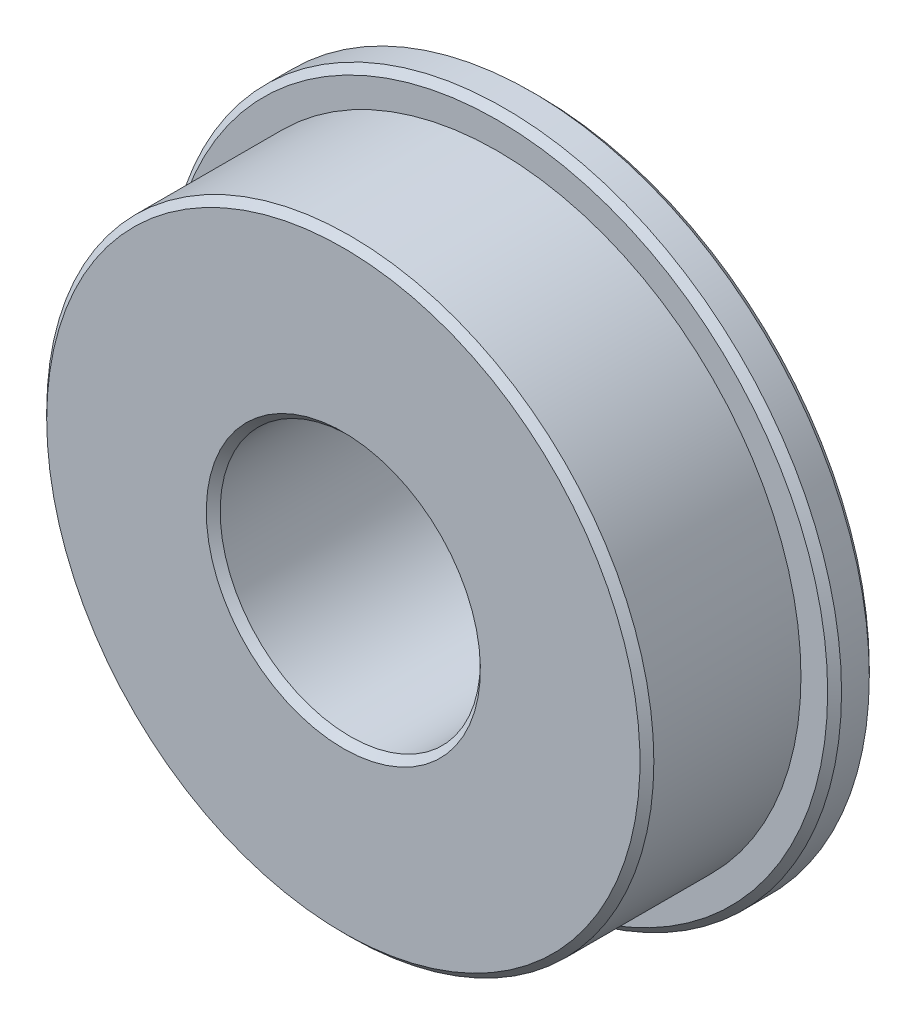
ISO-10303-21;
HEADER;
FILE_DESCRIPTION(('STEP AP214'),'2;1');
FILE_NAME('part.step','',(''),(''),'','','');
FILE_SCHEMA(('AUTOMOTIVE_DESIGN { 1 0 10303 214 1 1 1 1 }'));
ENDSEC;
DATA;
#1=APPLICATION_CONTEXT('core data for automotive mechanical design processes');
#2=APPLICATION_PROTOCOL_DEFINITION('international standard','automotive_design',2000,#1);
#3=PRODUCT_CONTEXT('',#1,'mechanical');
#4=PRODUCT('Part','Part','',(#3));
#5=PRODUCT_RELATED_PRODUCT_CATEGORY('part','',(#4));
#6=PRODUCT_DEFINITION_FORMATION('','',#4);
#7=PRODUCT_DEFINITION_CONTEXT('part definition',#1,'design');
#8=PRODUCT_DEFINITION('design','',#6,#7);
#9=PRODUCT_DEFINITION_SHAPE('','',#8);
#10=(LENGTH_UNIT() NAMED_UNIT(*) SI_UNIT(.MILLI.,.METRE.));
#11=(NAMED_UNIT(*) PLANE_ANGLE_UNIT() SI_UNIT($,.RADIAN.));
#12=(NAMED_UNIT(*) SI_UNIT($,.STERADIAN.) SOLID_ANGLE_UNIT());
#13=UNCERTAINTY_MEASURE_WITH_UNIT(LENGTH_MEASURE(1.E-05),#10,'distance_accuracy_value','');
#14=(GEOMETRIC_REPRESENTATION_CONTEXT(3) GLOBAL_UNCERTAINTY_ASSIGNED_CONTEXT((#13)) GLOBAL_UNIT_ASSIGNED_CONTEXT((#10,
#11,#12)) REPRESENTATION_CONTEXT('',''));
#15=CARTESIAN_POINT('',(0.,0.,0.));
#16=DIRECTION('',(0.,0.,1.));
#17=DIRECTION('',(1.,0.,0.));
#18=AXIS2_PLACEMENT_3D('',#15,#16,#17);
#19=CARTESIAN_POINT('',(-8.86153846153845,6.04195804195806,6.90880000000005));
#20=DIRECTION('',(0.,0.,-1.));
#21=DIRECTION('',(-1.,0.,0.));
#22=AXIS2_PLACEMENT_3D('',#19,#20,#21);
#23=CONICAL_SURFACE('',#22,11.1125,0.785398163397452);
#24=CARTESIAN_POINT('',(-8.86153846153845,6.04195804195806,7.16280000000004));
#25=DIRECTION('',(0.,0.,-1.));
#26=DIRECTION('',(-1.,0.,0.));
#27=AXIS2_PLACEMENT_3D('',#24,#25,#26);
#28=CIRCLE('',#27,10.8585);
#29=CARTESIAN_POINT('',(-19.7200384615385,6.04195804195806,7.16280000000004));
#30=VERTEX_POINT('',#29);
#31=EDGE_CURVE('E17',#30,#30,#28,.T.);
#32=ORIENTED_EDGE('',*,*,#31,.T.);
#33=EDGE_LOOP('',(#32));
#34=FACE_BOUND('',#33,.T.);
#35=CARTESIAN_POINT('',(-8.86153846153845,6.04195804195806,6.90880000000005));
#36=DIRECTION('',(0.,0.,1.));
#37=DIRECTION('',(1.,0.,0.));
#38=AXIS2_PLACEMENT_3D('',#35,#36,#37);
#39=CIRCLE('',#38,11.1125);
#40=CARTESIAN_POINT('',(2.25096153846156,6.04195804195806,6.90880000000005));
#41=VERTEX_POINT('',#40);
#42=EDGE_CURVE('E29',#41,#41,#39,.F.);
#43=ORIENTED_EDGE('',*,*,#42,.F.);
#44=EDGE_LOOP('',(#43));
#45=FACE_BOUND('',#44,.T.);
#46=ADVANCED_FACE('F14',(#34,#45),#23,.T.);
#47=CARTESIAN_POINT('',(-8.86153846153845,6.04195804195806,7.16280000000002));
#48=DIRECTION('',(0.,0.,1.));
#49=DIRECTION('',(1.,0.,0.));
#50=AXIS2_PLACEMENT_3D('',#47,#48,#49);
#51=CYLINDRICAL_SURFACE('',#50,11.1125);
#52=CARTESIAN_POINT('',(-8.86153846153845,6.04195804195806,1.52399999999997));
#53=DIRECTION('',(0.,0.,1.));
#54=DIRECTION('',(1.,0.,0.));
#55=AXIS2_PLACEMENT_3D('',#52,#53,#54);
#56=CIRCLE('',#55,11.1125);
#57=CARTESIAN_POINT('',(2.25096153846156,6.04195804195806,1.52399999999997));
#58=VERTEX_POINT('',#57);
#59=EDGE_CURVE('E38',#58,#58,#56,.T.);
#60=ORIENTED_EDGE('',*,*,#59,.T.);
#61=EDGE_LOOP('',(#60));
#62=FACE_BOUND('',#61,.T.);
#63=ORIENTED_EDGE('',*,*,#42,.T.);
#64=EDGE_LOOP('',(#63));
#65=FACE_BOUND('',#64,.T.);
#66=ADVANCED_FACE('F48',(#62,#65),#51,.T.);
#67=CARTESIAN_POINT('',(-8.86153846153845,6.04195804195806,7.16280000000002));
#68=DIRECTION('',(0.,0.,-1.));
#69=DIRECTION('',(-1.,0.,0.));
#70=AXIS2_PLACEMENT_3D('',#67,#68,#69);
#71=PLANE('',#70);
#72=ORIENTED_EDGE('',*,*,#31,.F.);
#73=EDGE_LOOP('',(#72));
#74=FACE_BOUND('',#73,.T.);
#75=CARTESIAN_POINT('',(-8.86153846153845,6.04195804195806,7.16280000011693));
#76=DIRECTION('',(0.,0.,1.));
#77=DIRECTION('',(0.,-1.,0.));
#78=AXIS2_PLACEMENT_3D('',#75,#76,#77);
#79=CIRCLE('',#78,5.01650000001817);
#80=CARTESIAN_POINT('',(-8.86153846153845,1.0254580419399,7.16280000011693));
#81=VERTEX_POINT('',#80);
#82=EDGE_CURVE('E36',#81,#81,#79,.F.);
#83=ORIENTED_EDGE('',*,*,#82,.T.);
#84=EDGE_LOOP('',(#83));
#85=FACE_BOUND('',#84,.T.);
#86=ADVANCED_FACE('F55',(#74,#85),#71,.F.);
#87=CARTESIAN_POINT('',(-8.86153846153845,6.04195804195806,1.52399999999997));
#88=DIRECTION('',(0.,0.,-1.));
#89=DIRECTION('',(-1.,0.,0.));
#90=AXIS2_PLACEMENT_3D('',#87,#88,#89);
#91=PLANE('',#90);
#92=ORIENTED_EDGE('',*,*,#59,.F.);
#93=EDGE_LOOP('',(#92));
#94=FACE_BOUND('',#93,.T.);
#95=CARTESIAN_POINT('',(-8.86153846153845,6.04195804195806,1.52399999999998));
#96=DIRECTION('',(0.,0.,-1.));
#97=DIRECTION('',(-1.,0.,0.));
#98=AXIS2_PLACEMENT_3D('',#95,#96,#97);
#99=CIRCLE('',#98,12.0904);
#100=CARTESIAN_POINT('',(-20.9519384615385,6.04195804195806,1.52399999999998));
#101=VERTEX_POINT('',#100);
#102=EDGE_CURVE('E32',#101,#101,#99,.T.);
#103=ORIENTED_EDGE('',*,*,#102,.F.);
#104=EDGE_LOOP('',(#103));
#105=FACE_BOUND('',#104,.T.);
#106=ADVANCED_FACE('F86',(#94,#105),#91,.F.);
#107=CARTESIAN_POINT('',(-8.86153846153845,6.04195804195806,7.16280000011693));
#108=DIRECTION('',(0.,0.,1.));
#109=DIRECTION('',(0.,-1.,0.));
#110=AXIS2_PLACEMENT_3D('',#107,#108,#109);
#111=CONICAL_SURFACE('',#110,5.01650000001817,0.785398163397448);
#112=CARTESIAN_POINT('',(-8.86153846153845,6.04195804195806,6.90880000000005));
#113=DIRECTION('',(0.,0.,1.));
#114=DIRECTION('',(1.,0.,0.));
#115=AXIS2_PLACEMENT_3D('',#112,#113,#114);
#116=CIRCLE('',#115,4.7625);
#117=CARTESIAN_POINT('',(-4.09903846153845,6.04195804195806,6.90880000000005));
#118=VERTEX_POINT('',#117);
#119=EDGE_CURVE('E35',#118,#118,#116,.F.);
#120=ORIENTED_EDGE('',*,*,#119,.T.);
#121=EDGE_LOOP('',(#120));
#122=FACE_BOUND('',#121,.T.);
#123=ORIENTED_EDGE('',*,*,#82,.F.);
#124=EDGE_LOOP('',(#123));
#125=FACE_BOUND('',#124,.T.);
#126=ADVANCED_FACE('F82',(#122,#125),#111,.F.);
#127=CARTESIAN_POINT('',(-8.86153846153845,6.04195804195806,1.27));
#128=DIRECTION('',(0.,0.,-1.));
#129=DIRECTION('',(-1.,0.,0.));
#130=AXIS2_PLACEMENT_3D('',#127,#128,#129);
#131=CONICAL_SURFACE('',#130,12.3444,0.78539816339745);
#132=CARTESIAN_POINT('',(-8.86153846153845,6.04195804195806,1.26999999999999));
#133=DIRECTION('',(0.,0.,1.));
#134=DIRECTION('',(1.,0.,0.));
#135=AXIS2_PLACEMENT_3D('',#132,#133,#134);
#136=CIRCLE('',#135,12.3444);
#137=CARTESIAN_POINT('',(3.48286153846156,6.04195804195806,1.26999999999999));
#138=VERTEX_POINT('',#137);
#139=EDGE_CURVE('E170',#138,#138,#136,.F.);
#140=ORIENTED_EDGE('',*,*,#139,.F.);
#141=EDGE_LOOP('',(#140));
#142=FACE_BOUND('',#141,.T.);
#143=ORIENTED_EDGE('',*,*,#102,.T.);
#144=EDGE_LOOP('',(#143));
#145=FACE_BOUND('',#144,.T.);
#146=ADVANCED_FACE('F78',(#142,#145),#131,.T.);
#147=CARTESIAN_POINT('',(-8.86153846153845,6.04195804195806,1.52399999999997));
#148=DIRECTION('',(0.,0.,1.));
#149=DIRECTION('',(1.,0.,0.));
#150=AXIS2_PLACEMENT_3D('',#147,#148,#149);
#151=CYLINDRICAL_SURFACE('',#150,4.7625);
#152=ORIENTED_EDGE('',*,*,#119,.F.);
#153=EDGE_LOOP('',(#152));
#154=FACE_BOUND('',#153,.T.);
#155=CARTESIAN_POINT('',(-8.86153846153845,6.04195804195806,0.253999999983989));
#156=DIRECTION('',(0.,0.,-1.));
#157=DIRECTION('',(-1.,0.,0.));
#158=AXIS2_PLACEMENT_3D('',#155,#156,#157);
#159=CIRCLE('',#158,4.76249999990543);
#160=CARTESIAN_POINT('',(-13.6240384614439,6.04195804195806,0.253999999983989));
#161=VERTEX_POINT('',#160);
#162=EDGE_CURVE('E172',#161,#161,#159,.T.);
#163=ORIENTED_EDGE('',*,*,#162,.T.);
#164=EDGE_LOOP('',(#163));
#165=FACE_BOUND('',#164,.T.);
#166=ADVANCED_FACE('F74',(#154,#165),#151,.F.);
#167=CARTESIAN_POINT('',(-8.86153846153845,6.04195804195806,1.52399999999997));
#168=DIRECTION('',(0.,0.,1.));
#169=DIRECTION('',(1.,0.,0.));
#170=AXIS2_PLACEMENT_3D('',#167,#168,#169);
#171=CYLINDRICAL_SURFACE('',#170,12.3444);
#172=CARTESIAN_POINT('',(-8.86153846153845,6.04195804195806,0.25399999999999));
#173=DIRECTION('',(0.,0.,1.));
#174=DIRECTION('',(1.,0.,0.));
#175=AXIS2_PLACEMENT_3D('',#172,#173,#174);
#176=CIRCLE('',#175,12.3444);
#177=CARTESIAN_POINT('',(3.48286153846154,6.04195804195807,0.25399999999999));
#178=VERTEX_POINT('',#177);
#179=EDGE_CURVE('E26',#178,#178,#176,.F.);
#180=ORIENTED_EDGE('',*,*,#179,.F.);
#181=EDGE_LOOP('',(#180));
#182=FACE_BOUND('',#181,.T.);
#183=ORIENTED_EDGE('',*,*,#139,.T.);
#184=EDGE_LOOP('',(#183));
#185=FACE_BOUND('',#184,.T.);
#186=ADVANCED_FACE('F70',(#182,#185),#171,.T.);
#187=CARTESIAN_POINT('',(-8.86153846153845,6.04195804195806,-5.6843418860808E-11));
#188=DIRECTION('',(0.,0.,-1.));
#189=DIRECTION('',(-1.,0.,0.));
#190=AXIS2_PLACEMENT_3D('',#187,#188,#189);
#191=CONICAL_SURFACE('',#190,5.01650000000311,0.785398163509345);
#192=ORIENTED_EDGE('',*,*,#162,.F.);
#193=EDGE_LOOP('',(#192));
#194=FACE_BOUND('',#193,.T.);
#195=CARTESIAN_POINT('',(-8.86153846153845,6.04195804195806,-6.43721187448625E-11));
#196=DIRECTION('',(0.,0.,-1.));
#197=DIRECTION('',(-1.,0.,0.));
#198=AXIS2_PLACEMENT_3D('',#195,#196,#197);
#199=CIRCLE('',#198,5.01650000001064);
#200=CARTESIAN_POINT('',(-13.8780384615491,6.04195804195806,-6.43721187448625E-11));
#201=VERTEX_POINT('',#200);
#202=EDGE_CURVE('E21',#201,#201,#199,.F.);
#203=ORIENTED_EDGE('',*,*,#202,.F.);
#204=EDGE_LOOP('',(#203));
#205=FACE_BOUND('',#204,.T.);
#206=ADVANCED_FACE('F63',(#194,#205),#191,.F.);
#207=CARTESIAN_POINT('',(-8.86153846153845,6.04195804195806,0.253999999999992));
#208=DIRECTION('',(0.,0.,1.));
#209=DIRECTION('',(1.,0.,0.));
#210=AXIS2_PLACEMENT_3D('',#207,#208,#209);
#211=CONICAL_SURFACE('',#210,12.3444,0.785398163397453);
#212=ORIENTED_EDGE('',*,*,#179,.T.);
#213=EDGE_LOOP('',(#212));
#214=FACE_BOUND('',#213,.T.);
#215=CARTESIAN_POINT('',(-8.86153846153845,6.04195804195806,0.));
#216=DIRECTION('',(0.,0.,1.));
#217=DIRECTION('',(1.,0.,0.));
#218=AXIS2_PLACEMENT_3D('',#215,#216,#217);
#219=CIRCLE('',#218,12.0904);
#220=CARTESIAN_POINT('',(3.22886153846155,6.04195804195806,0.));
#221=VERTEX_POINT('',#220);
#222=EDGE_CURVE('E9',#221,#221,#219,.F.);
#223=ORIENTED_EDGE('',*,*,#222,.F.);
#224=EDGE_LOOP('',(#223));
#225=FACE_BOUND('',#224,.T.);
#226=ADVANCED_FACE('F58',(#214,#225),#211,.T.);
#227=CARTESIAN_POINT('',(-8.86153846153845,6.04195804195806,0.));
#228=DIRECTION('',(0.,0.,-1.));
#229=DIRECTION('',(-1.,0.,0.));
#230=AXIS2_PLACEMENT_3D('',#227,#228,#229);
#231=PLANE('',#230);
#232=ORIENTED_EDGE('',*,*,#222,.T.);
#233=EDGE_LOOP('',(#232));
#234=FACE_BOUND('',#233,.T.);
#235=ORIENTED_EDGE('',*,*,#202,.T.);
#236=EDGE_LOOP('',(#235));
#237=FACE_BOUND('',#236,.T.);
#238=ADVANCED_FACE('F56',(#234,#237),#231,.T.);
#239=CLOSED_SHELL('',(#46,#66,#86,#106,#126,#146,#166,#186,#206,#226,#238));
#240=MANIFOLD_SOLID_BREP('B1',#239);
#241=ADVANCED_BREP_SHAPE_REPRESENTATION('',(#18,#240),#14);
#242=SHAPE_DEFINITION_REPRESENTATION(#9,#241);
ENDSEC;
END-ISO-10303-21;
